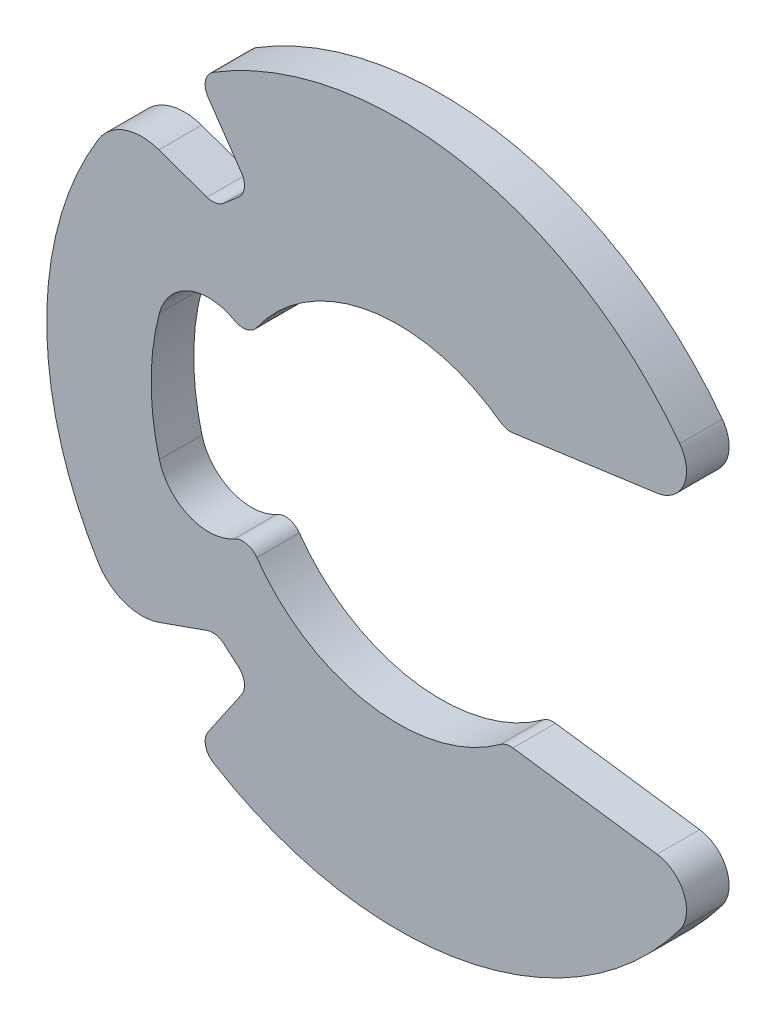
ISO-10303-21;
HEADER;
FILE_DESCRIPTION(('STEP AP214'),'2;1');
FILE_NAME('part.step','',(''),(''),'','','');
FILE_SCHEMA(('AUTOMOTIVE_DESIGN { 1 0 10303 214 1 1 1 1 }'));
ENDSEC;
DATA;
#1=APPLICATION_CONTEXT('core data for automotive mechanical design processes');
#2=APPLICATION_PROTOCOL_DEFINITION('international standard','automotive_design',2000,#1);
#3=PRODUCT_CONTEXT('',#1,'mechanical');
#4=PRODUCT('Part','Part','',(#3));
#5=PRODUCT_RELATED_PRODUCT_CATEGORY('part','',(#4));
#6=PRODUCT_DEFINITION_FORMATION('','',#4);
#7=PRODUCT_DEFINITION_CONTEXT('part definition',#1,'design');
#8=PRODUCT_DEFINITION('design','',#6,#7);
#9=PRODUCT_DEFINITION_SHAPE('','',#8);
#10=(LENGTH_UNIT() NAMED_UNIT(*) SI_UNIT(.MILLI.,.METRE.));
#11=(NAMED_UNIT(*) PLANE_ANGLE_UNIT() SI_UNIT($,.RADIAN.));
#12=(NAMED_UNIT(*) SI_UNIT($,.STERADIAN.) SOLID_ANGLE_UNIT());
#13=UNCERTAINTY_MEASURE_WITH_UNIT(LENGTH_MEASURE(1.E-05),#10,'distance_accuracy_value','');
#14=(GEOMETRIC_REPRESENTATION_CONTEXT(3) GLOBAL_UNCERTAINTY_ASSIGNED_CONTEXT((#13)) GLOBAL_UNIT_ASSIGNED_CONTEXT((#10,
#11,#12)) REPRESENTATION_CONTEXT('',''));
#15=CARTESIAN_POINT('',(0.,0.,0.));
#16=DIRECTION('',(0.,0.,1.));
#17=DIRECTION('',(1.,0.,0.));
#18=AXIS2_PLACEMENT_3D('',#15,#16,#17);
#19=CARTESIAN_POINT('',(0.,0.,1.27));
#20=DIRECTION('',(0.,0.,-1.));
#21=DIRECTION('',(-1.,0.,0.));
#22=AXIS2_PLACEMENT_3D('',#19,#20,#21);
#23=PLANE('',#22);
#24=CARTESIAN_POINT('',(7.57687706687955,-5.66664946537147,1.27));
#25=DIRECTION('',(0.,0.,-1.));
#26=DIRECTION('',(-1.,0.,0.));
#27=AXIS2_PLACEMENT_3D('',#24,#25,#26);
#28=CIRCLE('',#27,1.016);
#29=CARTESIAN_POINT('',(7.71621548730133,-4.66024954258016,1.27));
#30=VERTEX_POINT('',#29);
#31=CARTESIAN_POINT('',(8.39050144990017,-6.27514873682076,1.27));
#32=VERTEX_POINT('',#31);
#33=EDGE_CURVE('E373',#30,#32,#28,.T.);
#34=ORIENTED_EDGE('',*,*,#33,.F.);
#35=DIRECTION('',(0.990551105109562,-0.137144114588364,0.));
#36=VECTOR('',#35,1.);
#37=CARTESIAN_POINT('',(0.,-3.59192148204873,1.27));
#38=LINE('',#37,#36);
#39=CARTESIAN_POINT('',(3.41825205926127,-4.06518646523744,1.27));
#40=VERTEX_POINT('',#39);
#41=EDGE_CURVE('E374',#30,#40,#38,.F.);
#42=ORIENTED_EDGE('',*,*,#41,.T.);
#43=CARTESIAN_POINT('',(3.34858284905039,-4.5683864266331,1.27));
#44=DIRECTION('',(0.,0.,-1.));
#45=DIRECTION('',(-1.,0.,0.));
#46=AXIS2_PLACEMENT_3D('',#43,#44,#45);
#47=CIRCLE('',#46,0.508);
#48=CARTESIAN_POINT('',(3.04826151729699,-4.15866567088125,1.27));
#49=VERTEX_POINT('',#48);
#50=EDGE_CURVE('E17',#49,#40,#47,.T.);
#51=ORIENTED_EDGE('',*,*,#50,.F.);
#52=CARTESIAN_POINT('',(0.,0.,1.27));
#53=DIRECTION('',(0.,0.,-1.));
#54=DIRECTION('',(-1.,0.,0.));
#55=AXIS2_PLACEMENT_3D('',#52,#53,#54);
#56=CIRCLE('',#55,5.1562);
#57=CARTESIAN_POINT('',(-4.21618561440546,-2.96819428354689,1.27));
#58=VERTEX_POINT('',#57);
#59=EDGE_CURVE('E297',#49,#58,#56,.T.);
#60=ORIENTED_EDGE('',*,*,#59,.T.);
#61=CARTESIAN_POINT('',(-4.63157335966707,-3.26062721788648,1.27));
#62=DIRECTION('',(0.,0.,-1.));
#63=DIRECTION('',(-1.,0.,0.));
#64=AXIS2_PLACEMENT_3D('',#61,#62,#63);
#65=CIRCLE('',#64,0.508);
#66=CARTESIAN_POINT('',(-4.88521418696267,-2.82047913970278,1.27));
#67=VERTEX_POINT('',#66);
#68=EDGE_CURVE('E300',#67,#58,#65,.T.);
#69=ORIENTED_EDGE('',*,*,#68,.F.);
#70=CARTESIAN_POINT('',(-5.64613666884946,-1.50003490515168,1.27));
#71=DIRECTION('',(0.,0.,1.));
#72=DIRECTION('',(1.,0.,0.));
#73=AXIS2_PLACEMENT_3D('',#70,#71,#72);
#74=CIRCLE('',#73,1.524);
#75=CARTESIAN_POINT('',(-7.1190418868102,-1.89134835866951,1.27));
#76=VERTEX_POINT('',#75);
#77=EDGE_CURVE('E303',#67,#76,#74,.F.);
#78=ORIENTED_EDGE('',*,*,#77,.T.);
#79=CARTESIAN_POINT('',(0.,0.,1.27));
#80=DIRECTION('',(0.,0.,1.));
#81=DIRECTION('',(1.,0.,0.));
#82=AXIS2_PLACEMENT_3D('',#79,#80,#81);
#83=CIRCLE('',#82,7.366);
#84=CARTESIAN_POINT('',(-7.1190418868102,1.89134835866951,1.27));
#85=VERTEX_POINT('',#84);
#86=EDGE_CURVE('E307',#76,#85,#83,.F.);
#87=ORIENTED_EDGE('',*,*,#86,.T.);
#88=CARTESIAN_POINT('',(-5.64613666884946,1.50003490515168,1.27));
#89=DIRECTION('',(0.,0.,1.));
#90=DIRECTION('',(1.,0.,0.));
#91=AXIS2_PLACEMENT_3D('',#88,#89,#90);
#92=CIRCLE('',#91,1.524);
#93=CARTESIAN_POINT('',(-4.88521418696268,2.82047913970279,1.27));
#94=VERTEX_POINT('',#93);
#95=EDGE_CURVE('E311',#85,#94,#92,.F.);
#96=ORIENTED_EDGE('',*,*,#95,.T.);
#97=CARTESIAN_POINT('',(-4.63157335966708,3.26062721788649,1.27));
#98=DIRECTION('',(0.,0.,1.));
#99=DIRECTION('',(1.,0.,0.));
#100=AXIS2_PLACEMENT_3D('',#97,#98,#99);
#101=CIRCLE('',#100,0.508);
#102=CARTESIAN_POINT('',(-4.21618561440546,2.96819428354689,1.27));
#103=VERTEX_POINT('',#102);
#104=EDGE_CURVE('E313',#103,#94,#101,.F.);
#105=ORIENTED_EDGE('',*,*,#104,.F.);
#106=CARTESIAN_POINT('',(0.,0.,1.27));
#107=DIRECTION('',(0.,0.,-1.));
#108=DIRECTION('',(-1.,0.,0.));
#109=AXIS2_PLACEMENT_3D('',#106,#107,#108);
#110=CIRCLE('',#109,5.1562);
#111=CARTESIAN_POINT('',(3.048261517297,4.15866567088126,1.27));
#112=VERTEX_POINT('',#111);
#113=EDGE_CURVE('E317',#103,#112,#110,.T.);
#114=ORIENTED_EDGE('',*,*,#113,.T.);
#115=CARTESIAN_POINT('',(3.3485828490504,4.5683864266331,1.27));
#116=DIRECTION('',(0.,0.,-1.));
#117=DIRECTION('',(-1.,0.,0.));
#118=AXIS2_PLACEMENT_3D('',#115,#116,#117);
#119=CIRCLE('',#118,0.508);
#120=CARTESIAN_POINT('',(3.41825205926129,4.06518646523745,1.27));
#121=VERTEX_POINT('',#120);
#122=EDGE_CURVE('E321',#121,#112,#119,.T.);
#123=ORIENTED_EDGE('',*,*,#122,.F.);
#124=DIRECTION('',(-0.990551105109562,-0.137144114588364,0.));
#125=VECTOR('',#124,1.);
#126=CARTESIAN_POINT('',(11.2983179723503,5.15619999999999,1.27));
#127=LINE('',#126,#125);
#128=CARTESIAN_POINT('',(7.71621548730134,4.66024954258016,1.27));
#129=VERTEX_POINT('',#128);
#130=EDGE_CURVE('E327',#121,#129,#127,.F.);
#131=ORIENTED_EDGE('',*,*,#130,.T.);
#132=CARTESIAN_POINT('',(7.57687706687956,5.66664946537147,1.27));
#133=DIRECTION('',(0.,0.,-1.));
#134=DIRECTION('',(-1.,0.,0.));
#135=AXIS2_PLACEMENT_3D('',#132,#133,#134);
#136=CIRCLE('',#135,1.016);
#137=CARTESIAN_POINT('',(8.39050144990018,6.27514873682076,1.27));
#138=VERTEX_POINT('',#137);
#139=EDGE_CURVE('E324',#138,#129,#136,.T.);
#140=ORIENTED_EDGE('',*,*,#139,.F.);
#141=CARTESIAN_POINT('',(0.,0.,1.27));
#142=DIRECTION('',(0.,0.,-1.));
#143=DIRECTION('',(-1.,0.,0.));
#144=AXIS2_PLACEMENT_3D('',#141,#142,#143);
#145=CIRCLE('',#144,10.4775);
#146=CARTESIAN_POINT('',(-5.51465485817056,8.90879273780999,1.27));
#147=VERTEX_POINT('',#146);
#148=EDGE_CURVE('E329',#147,#138,#145,.T.);
#149=ORIENTED_EDGE('',*,*,#148,.F.);
#150=CARTESIAN_POINT('',(-5.24727765292592,8.47685127173435,1.27));
#151=DIRECTION('',(0.,0.,-1.));
#152=DIRECTION('',(-1.,0.,0.));
#153=AXIS2_PLACEMENT_3D('',#150,#151,#152);
#154=CIRCLE('',#153,0.508);
#155=CARTESIAN_POINT('',(-5.6664647231543,8.18989099547063,1.27));
#156=VERTEX_POINT('',#155);
#157=EDGE_CURVE('E332',#156,#147,#154,.T.);
#158=ORIENTED_EDGE('',*,*,#157,.F.);
#159=DIRECTION('',(0.564882433590001,-0.825171398087354,0.));
#160=VECTOR('',#159,1.);
#161=CARTESIAN_POINT('',(-7.96096866359448,11.541666359447,1.27));
#162=LINE('',#161,#160);
#163=CARTESIAN_POINT('',(-4.67174469224146,6.73681957776462,1.27));
#164=VERTEX_POINT('',#163);
#165=EDGE_CURVE('E383',#164,#156,#162,.F.);
#166=ORIENTED_EDGE('',*,*,#165,.F.);
#167=CARTESIAN_POINT('',(-5.09093176246983,6.4498593015009,1.27));
#168=DIRECTION('',(0.,0.,-1.));
#169=DIRECTION('',(-1.,0.,0.));
#170=AXIS2_PLACEMENT_3D('',#167,#168,#169);
#171=CIRCLE('',#170,0.508);
#172=CARTESIAN_POINT('',(-4.75923843445855,6.0650950410078,1.27000000000001));
#173=VERTEX_POINT('',#172);
#174=EDGE_CURVE('E336',#164,#173,#171,.T.);
#175=ORIENTED_EDGE('',*,*,#174,.T.);
#176=DIRECTION('',(-0.757409961600578,-0.652939622069462,0.));
#177=VECTOR('',#176,1.);
#178=CARTESIAN_POINT('',(-4.41503502304148,6.36182211981562,1.27000000000001));
#179=LINE('',#178,#177);
#180=CARTESIAN_POINT('',(-5.19974545035898,5.68534761350743,1.27000000000001));
#181=VERTEX_POINT('',#180);
#182=EDGE_CURVE('E387',#181,#173,#179,.F.);
#183=ORIENTED_EDGE('',*,*,#182,.F.);
#184=CARTESIAN_POINT('',(-5.53143877837027,6.07011187400052,1.27));
#185=DIRECTION('',(0.,0.,-1.));
#186=DIRECTION('',(-1.,0.,0.));
#187=AXIS2_PLACEMENT_3D('',#184,#185,#186);
#188=CIRCLE('',#187,0.508);
#189=CARTESIAN_POINT('',(-5.70123922502142,5.59133028672186,1.27));
#190=VERTEX_POINT('',#189);
#191=EDGE_CURVE('E340',#181,#190,#188,.T.);
#192=ORIENTED_EDGE('',*,*,#191,.T.);
#193=DIRECTION('',(-0.942483439524914,0.334252847738487,0.));
#194=VECTOR('',#193,1.);
#195=CARTESIAN_POINT('',(-5.42319262672811,5.49272073732714,1.27));
#196=LINE('',#195,#194);
#197=CARTESIAN_POINT('',(-7.13394241485243,6.09944013892937,1.27));
#198=VERTEX_POINT('',#197);
#199=EDGE_CURVE('E390',#198,#190,#196,.F.);
#200=ORIENTED_EDGE('',*,*,#199,.F.);
#201=CARTESIAN_POINT('',(-7.64334375480589,4.6630953770934,1.27));
#202=DIRECTION('',(0.,0.,-1.));
#203=DIRECTION('',(-1.,0.,0.));
#204=AXIS2_PLACEMENT_3D('',#201,#202,#203);
#205=CIRCLE('',#204,1.524);
#206=CARTESIAN_POINT('',(-8.94433843647498,5.45681373915185,1.27));
#207=VERTEX_POINT('',#206);
#208=EDGE_CURVE('E344',#207,#198,#205,.T.);
#209=ORIENTED_EDGE('',*,*,#208,.F.);
#210=CARTESIAN_POINT('',(0.,0.,1.27));
#211=DIRECTION('',(0.,0.,-1.));
#212=DIRECTION('',(-1.,0.,0.));
#213=AXIS2_PLACEMENT_3D('',#210,#211,#212);
#214=CIRCLE('',#213,10.4775);
#215=CARTESIAN_POINT('',(-8.94433843647497,-5.45681373915185,1.27));
#216=VERTEX_POINT('',#215);
#217=EDGE_CURVE('E348',#216,#207,#214,.T.);
#218=ORIENTED_EDGE('',*,*,#217,.F.);
#219=CARTESIAN_POINT('',(-7.64334375480588,-4.6630953770934,1.27));
#220=DIRECTION('',(0.,0.,-1.));
#221=DIRECTION('',(-1.,0.,0.));
#222=AXIS2_PLACEMENT_3D('',#219,#220,#221);
#223=CIRCLE('',#222,1.524);
#224=CARTESIAN_POINT('',(-7.13394241485243,-6.09944013892937,1.27));
#225=VERTEX_POINT('',#224);
#226=EDGE_CURVE('E352',#225,#216,#223,.T.);
#227=ORIENTED_EDGE('',*,*,#226,.F.);
#228=DIRECTION('',(-0.942483439524914,-0.334252847738487,0.));
#229=VECTOR('',#228,1.);
#230=CARTESIAN_POINT('',(-5.42319262672811,-5.49272073732714,1.27));
#231=LINE('',#230,#229);
#232=CARTESIAN_POINT('',(-5.70123922502142,-5.59133028672186,1.27));
#233=VERTEX_POINT('',#232);
#234=EDGE_CURVE('E393',#225,#233,#231,.F.);
#235=ORIENTED_EDGE('',*,*,#234,.T.);
#236=CARTESIAN_POINT('',(-5.53143877837027,-6.07011187400052,1.27));
#237=DIRECTION('',(0.,0.,-1.));
#238=DIRECTION('',(-1.,0.,0.));
#239=AXIS2_PLACEMENT_3D('',#236,#237,#238);
#240=CIRCLE('',#239,0.508);
#241=CARTESIAN_POINT('',(-5.19974545035898,-5.68534761350743,1.27000000000001));
#242=VERTEX_POINT('',#241);
#243=EDGE_CURVE('E357',#233,#242,#240,.T.);
#244=ORIENTED_EDGE('',*,*,#243,.T.);
#245=DIRECTION('',(-0.757409961600578,0.652939622069462,0.));
#246=VECTOR('',#245,1.);
#247=CARTESIAN_POINT('',(-4.41503502304148,-6.36182211981562,1.27000000000001));
#248=LINE('',#247,#246);
#249=CARTESIAN_POINT('',(-4.75923843445855,-6.0650950410078,1.27000000000001));
#250=VERTEX_POINT('',#249);
#251=EDGE_CURVE('E395',#242,#250,#248,.F.);
#252=ORIENTED_EDGE('',*,*,#251,.T.);
#253=CARTESIAN_POINT('',(-5.09093176246983,-6.4498593015009,1.27));
#254=DIRECTION('',(0.,0.,-1.));
#255=DIRECTION('',(-1.,0.,0.));
#256=AXIS2_PLACEMENT_3D('',#253,#254,#255);
#257=CIRCLE('',#256,0.508);
#258=CARTESIAN_POINT('',(-4.67174469224146,-6.73681957776462,1.27));
#259=VERTEX_POINT('',#258);
#260=EDGE_CURVE('E361',#250,#259,#257,.T.);
#261=ORIENTED_EDGE('',*,*,#260,.T.);
#262=DIRECTION('',(0.56488243359,0.825171398087354,0.));
#263=VECTOR('',#262,1.);
#264=CARTESIAN_POINT('',(-7.96096866359448,-11.541666359447,1.27));
#265=LINE('',#264,#263);
#266=CARTESIAN_POINT('',(-5.66646472315429,-8.18989099547062,1.27));
#267=VERTEX_POINT('',#266);
#268=EDGE_CURVE('E368',#259,#267,#265,.F.);
#269=ORIENTED_EDGE('',*,*,#268,.T.);
#270=CARTESIAN_POINT('',(-5.24727765292592,-8.47685127173434,1.27));
#271=DIRECTION('',(0.,0.,-1.));
#272=DIRECTION('',(-1.,0.,0.));
#273=AXIS2_PLACEMENT_3D('',#270,#271,#272);
#274=CIRCLE('',#273,0.508);
#275=CARTESIAN_POINT('',(-5.51465485817055,-8.90879273780997,1.27));
#276=VERTEX_POINT('',#275);
#277=EDGE_CURVE('E365',#276,#267,#274,.T.);
#278=ORIENTED_EDGE('',*,*,#277,.F.);
#279=CARTESIAN_POINT('',(0.,0.,1.27));
#280=DIRECTION('',(0.,0.,-1.));
#281=DIRECTION('',(-1.,0.,0.));
#282=AXIS2_PLACEMENT_3D('',#279,#280,#281);
#283=CIRCLE('',#282,10.4775);
#284=EDGE_CURVE('E370',#32,#276,#283,.T.);
#285=ORIENTED_EDGE('',*,*,#284,.F.);
#286=EDGE_LOOP('',(#34,#42,#51,#60,#69,#78,#87,#96,#105,#114,#123,#131,#140,#149,#158,#166,#175,
#183,#192,#200,#209,#218,#227,#235,#244,#252,#261,#269,#278,#285));
#287=FACE_BOUND('',#286,.T.);
#288=ADVANCED_FACE('F14',(#287),#23,.F.);
#289=CARTESIAN_POINT('',(0.,-3.59192148204873,-28.9774986298856));
#290=DIRECTION('',(-0.137144114588364,-0.990551105109562,0.));
#291=DIRECTION('',(0.990551105109562,-0.137144114588364,0.));
#292=AXIS2_PLACEMENT_3D('',#289,#290,#291);
#293=PLANE('',#292);
#294=DIRECTION('',(0.,0.,-1.));
#295=VECTOR('',#294,1.);
#296=CARTESIAN_POINT('',(7.71621548730133,-4.66024954258016,1.27));
#297=LINE('',#296,#295);
#298=CARTESIAN_POINT('',(7.71621548730133,-4.66024954258016,0.));
#299=VERTEX_POINT('',#298);
#300=EDGE_CURVE('E219',#299,#30,#297,.F.);
#301=ORIENTED_EDGE('',*,*,#300,.F.);
#302=DIRECTION('',(0.990551105109562,-0.137144114588363,0.));
#303=VECTOR('',#302,1.);
#304=CARTESIAN_POINT('',(3.41825205926127,-4.06518646523744,0.));
#305=LINE('',#304,#303);
#306=CARTESIAN_POINT('',(3.41825205926127,-4.06518646523744,0.));
#307=VERTEX_POINT('',#306);
#308=EDGE_CURVE('E214',#307,#299,#305,.T.);
#309=ORIENTED_EDGE('',*,*,#308,.F.);
#310=DIRECTION('',(0.,0.,-1.));
#311=VECTOR('',#310,1.);
#312=CARTESIAN_POINT('',(3.41825205926127,-4.06518646523744,1.27));
#313=LINE('',#312,#311);
#314=EDGE_CURVE('E217',#40,#307,#313,.T.);
#315=ORIENTED_EDGE('',*,*,#314,.F.);
#316=ORIENTED_EDGE('',*,*,#41,.F.);
#317=EDGE_LOOP('',(#301,#309,#315,#316));
#318=FACE_BOUND('',#317,.T.);
#319=ADVANCED_FACE('F215',(#318),#293,.F.);
#320=CARTESIAN_POINT('',(7.57687706687955,-5.66664946537147,1.27));
#321=DIRECTION('',(0.,0.,-1.));
#322=DIRECTION('',(-1.,0.,0.));
#323=AXIS2_PLACEMENT_3D('',#320,#321,#322);
#324=CYLINDRICAL_SURFACE('',#323,1.016);
#325=CARTESIAN_POINT('',(7.57687706687955,-5.66664946537147,0.));
#326=DIRECTION('',(0.,0.,-1.));
#327=DIRECTION('',(-1.,0.,0.));
#328=AXIS2_PLACEMENT_3D('',#325,#326,#327);
#329=CIRCLE('',#328,1.016);
#330=CARTESIAN_POINT('',(8.39050144990017,-6.27514873682076,0.));
#331=VERTEX_POINT('',#330);
#332=EDGE_CURVE('E223',#299,#331,#329,.T.);
#333=ORIENTED_EDGE('',*,*,#332,.F.);
#334=ORIENTED_EDGE('',*,*,#300,.T.);
#335=ORIENTED_EDGE('',*,*,#33,.T.);
#336=DIRECTION('',(0.,0.,-1.));
#337=VECTOR('',#336,1.);
#338=CARTESIAN_POINT('',(8.39050144990017,-6.27514873682076,1.27));
#339=LINE('',#338,#337);
#340=EDGE_CURVE('E372',#331,#32,#339,.F.);
#341=ORIENTED_EDGE('',*,*,#340,.F.);
#342=EDGE_LOOP('',(#333,#334,#335,#341));
#343=FACE_BOUND('',#342,.T.);
#344=ADVANCED_FACE('F411',(#343),#324,.T.);
#345=CARTESIAN_POINT('',(0.,0.,1.27));
#346=DIRECTION('',(0.,0.,-1.));
#347=DIRECTION('',(-1.,0.,0.));
#348=AXIS2_PLACEMENT_3D('',#345,#346,#347);
#349=CYLINDRICAL_SURFACE('',#348,10.4775);
#350=ORIENTED_EDGE('',*,*,#284,.T.);
#351=DIRECTION('',(0.,0.,-1.));
#352=VECTOR('',#351,1.);
#353=CARTESIAN_POINT('',(-5.51465485817055,-8.90879273780998,1.27));
#354=LINE('',#353,#352);
#355=CARTESIAN_POINT('',(-5.51465485817055,-8.90879273780997,0.));
#356=VERTEX_POINT('',#355);
#357=EDGE_CURVE('E369',#356,#276,#354,.F.);
#358=ORIENTED_EDGE('',*,*,#357,.F.);
#359=CARTESIAN_POINT('',(0.,0.,0.));
#360=DIRECTION('',(0.,0.,-1.));
#361=DIRECTION('',(-1.,0.,0.));
#362=AXIS2_PLACEMENT_3D('',#359,#360,#361);
#363=CIRCLE('',#362,10.4775);
#364=EDGE_CURVE('E293',#331,#356,#363,.T.);
#365=ORIENTED_EDGE('',*,*,#364,.F.);
#366=ORIENTED_EDGE('',*,*,#340,.T.);
#367=EDGE_LOOP('',(#350,#358,#365,#366));
#368=FACE_BOUND('',#367,.T.);
#369=ADVANCED_FACE('F410',(#368),#349,.T.);
#370=CARTESIAN_POINT('',(-5.24727765292592,-8.47685127173434,1.27));
#371=DIRECTION('',(0.,0.,-1.));
#372=DIRECTION('',(-1.,0.,0.));
#373=AXIS2_PLACEMENT_3D('',#370,#371,#372);
#374=CYLINDRICAL_SURFACE('',#373,0.508);
#375=DIRECTION('',(0.,0.,1.));
#376=VECTOR('',#375,1.);
#377=CARTESIAN_POINT('',(-5.66646472315429,-8.18989099547062,-28.9619533727259));
#378=LINE('',#377,#376);
#379=CARTESIAN_POINT('',(-5.6664647231543,-8.18989099547062,0.));
#380=VERTEX_POINT('',#379);
#381=EDGE_CURVE('E364',#267,#380,#378,.F.);
#382=ORIENTED_EDGE('',*,*,#381,.T.);
#383=CARTESIAN_POINT('',(-5.24727765292592,-8.47685127173434,0.));
#384=DIRECTION('',(0.,0.,-1.));
#385=DIRECTION('',(-1.,0.,0.));
#386=AXIS2_PLACEMENT_3D('',#383,#384,#385);
#387=CIRCLE('',#386,0.508);
#388=EDGE_CURVE('E291',#356,#380,#387,.T.);
#389=ORIENTED_EDGE('',*,*,#388,.F.);
#390=ORIENTED_EDGE('',*,*,#357,.T.);
#391=ORIENTED_EDGE('',*,*,#277,.T.);
#392=EDGE_LOOP('',(#382,#389,#390,#391));
#393=FACE_BOUND('',#392,.T.);
#394=ADVANCED_FACE('F413',(#393),#374,.T.);
#395=CARTESIAN_POINT('',(-7.96096866359448,-11.541666359447,-28.9619533727259));
#396=DIRECTION('',(0.825171398087354,-0.56488243359,0.));
#397=DIRECTION('',(0.56488243359,0.825171398087354,0.));
#398=AXIS2_PLACEMENT_3D('',#395,#396,#397);
#399=PLANE('',#398);
#400=ORIENTED_EDGE('',*,*,#381,.F.);
#401=ORIENTED_EDGE('',*,*,#268,.F.);
#402=DIRECTION('',(0.,0.,-1.));
#403=VECTOR('',#402,1.);
#404=CARTESIAN_POINT('',(-4.67174469224146,-6.73681957776462,-28.9619533727259));
#405=LINE('',#404,#403);
#406=CARTESIAN_POINT('',(-4.67174469224146,-6.73681957776462,0.));
#407=VERTEX_POINT('',#406);
#408=EDGE_CURVE('E363',#259,#407,#405,.T.);
#409=ORIENTED_EDGE('',*,*,#408,.T.);
#410=DIRECTION('',(0.564882433590003,0.825171398087353,0.));
#411=VECTOR('',#410,1.);
#412=CARTESIAN_POINT('',(-5.6664647231543,-8.18989099547062,0.));
#413=LINE('',#412,#411);
#414=EDGE_CURVE('E290',#380,#407,#413,.T.);
#415=ORIENTED_EDGE('',*,*,#414,.F.);
#416=EDGE_LOOP('',(#400,#401,#409,#415));
#417=FACE_BOUND('',#416,.T.);
#418=ADVANCED_FACE('F415',(#417),#399,.F.);
#419=CARTESIAN_POINT('',(-5.09093176246983,-6.4498593015009,-28.9619533727259));
#420=DIRECTION('',(0.,0.,-1.));
#421=DIRECTION('',(-1.,0.,0.));
#422=AXIS2_PLACEMENT_3D('',#419,#420,#421);
#423=CYLINDRICAL_SURFACE('',#422,0.508);
#424=ORIENTED_EDGE('',*,*,#408,.F.);
#425=ORIENTED_EDGE('',*,*,#260,.F.);
#426=DIRECTION('',(0.,0.,1.));
#427=VECTOR('',#426,1.);
#428=CARTESIAN_POINT('',(-4.75923843445855,-6.0650950410078,-28.9619533727259));
#429=LINE('',#428,#427);
#430=CARTESIAN_POINT('',(-4.75923843445855,-6.0650950410078,0.));
#431=VERTEX_POINT('',#430);
#432=EDGE_CURVE('E360',#250,#431,#429,.F.);
#433=ORIENTED_EDGE('',*,*,#432,.T.);
#434=CARTESIAN_POINT('',(-5.09093176246983,-6.4498593015009,0.));
#435=DIRECTION('',(0.,0.,-1.));
#436=DIRECTION('',(-1.,0.,0.));
#437=AXIS2_PLACEMENT_3D('',#434,#435,#436);
#438=CIRCLE('',#437,0.508);
#439=EDGE_CURVE('E287',#407,#431,#438,.F.);
#440=ORIENTED_EDGE('',*,*,#439,.F.);
#441=EDGE_LOOP('',(#424,#425,#433,#440));
#442=FACE_BOUND('',#441,.T.);
#443=ADVANCED_FACE('F460',(#442),#423,.F.);
#444=CARTESIAN_POINT('',(-4.41503502304148,-6.36182211981562,-28.9619533727259));
#445=DIRECTION('',(0.652939622069462,0.757409961600578,0.));
#446=DIRECTION('',(-0.757409961600578,0.652939622069462,0.));
#447=AXIS2_PLACEMENT_3D('',#444,#445,#446);
#448=PLANE('',#447);
#449=ORIENTED_EDGE('',*,*,#432,.F.);
#450=ORIENTED_EDGE('',*,*,#251,.F.);
#451=DIRECTION('',(0.,0.,-1.));
#452=VECTOR('',#451,1.);
#453=CARTESIAN_POINT('',(-5.19974545035899,-5.68534761350743,-28.9619533727259));
#454=LINE('',#453,#452);
#455=CARTESIAN_POINT('',(-5.19974545035898,-5.68534761350743,0.));
#456=VERTEX_POINT('',#455);
#457=EDGE_CURVE('E359',#242,#456,#454,.T.);
#458=ORIENTED_EDGE('',*,*,#457,.T.);
#459=DIRECTION('',(-0.757409961600581,0.652939622069458,0.));
#460=VECTOR('',#459,1.);
#461=CARTESIAN_POINT('',(-4.75923843445854,-6.0650950410078,0.));
#462=LINE('',#461,#460);
#463=EDGE_CURVE('E286',#431,#456,#462,.T.);
#464=ORIENTED_EDGE('',*,*,#463,.F.);
#465=EDGE_LOOP('',(#449,#450,#458,#464));
#466=FACE_BOUND('',#465,.T.);
#467=ADVANCED_FACE('F464',(#466),#448,.F.);
#468=CARTESIAN_POINT('',(-5.53143877837027,-6.07011187400052,-28.9619533727259));
#469=DIRECTION('',(0.,0.,-1.));
#470=DIRECTION('',(-1.,0.,0.));
#471=AXIS2_PLACEMENT_3D('',#468,#469,#470);
#472=CYLINDRICAL_SURFACE('',#471,0.508);
#473=ORIENTED_EDGE('',*,*,#457,.F.);
#474=ORIENTED_EDGE('',*,*,#243,.F.);
#475=DIRECTION('',(0.,0.,1.));
#476=VECTOR('',#475,1.);
#477=CARTESIAN_POINT('',(-5.70123922502142,-5.59133028672186,-28.9619533727259));
#478=LINE('',#477,#476);
#479=CARTESIAN_POINT('',(-5.70123922502142,-5.59133028672186,0.));
#480=VERTEX_POINT('',#479);
#481=EDGE_CURVE('E356',#233,#480,#478,.F.);
#482=ORIENTED_EDGE('',*,*,#481,.T.);
#483=CARTESIAN_POINT('',(-5.53143877837027,-6.07011187400052,0.));
#484=DIRECTION('',(0.,0.,-1.));
#485=DIRECTION('',(-1.,0.,0.));
#486=AXIS2_PLACEMENT_3D('',#483,#484,#485);
#487=CIRCLE('',#486,0.508);
#488=EDGE_CURVE('E283',#456,#480,#487,.F.);
#489=ORIENTED_EDGE('',*,*,#488,.F.);
#490=EDGE_LOOP('',(#473,#474,#482,#489));
#491=FACE_BOUND('',#490,.T.);
#492=ADVANCED_FACE('F470',(#491),#472,.F.);
#493=CARTESIAN_POINT('',(-5.42319262672811,-5.49272073732714,-28.9619533727259));
#494=DIRECTION('',(-0.334252847738487,0.942483439524914,0.));
#495=DIRECTION('',(-0.942483439524914,-0.334252847738487,0.));
#496=AXIS2_PLACEMENT_3D('',#493,#494,#495);
#497=PLANE('',#496);
#498=ORIENTED_EDGE('',*,*,#481,.F.);
#499=ORIENTED_EDGE('',*,*,#234,.F.);
#500=DIRECTION('',(0.,0.,-1.));
#501=VECTOR('',#500,1.);
#502=CARTESIAN_POINT('',(-7.13394241485243,-6.09944013892937,1.27));
#503=LINE('',#502,#501);
#504=CARTESIAN_POINT('',(-7.13394241485243,-6.09944013892937,0.));
#505=VERTEX_POINT('',#504);
#506=EDGE_CURVE('E355',#505,#225,#503,.F.);
#507=ORIENTED_EDGE('',*,*,#506,.F.);
#508=DIRECTION('',(-0.942483439524914,-0.334252847738488,0.));
#509=VECTOR('',#508,1.);
#510=CARTESIAN_POINT('',(-5.70123922502142,-5.59133028672186,0.));
#511=LINE('',#510,#509);
#512=EDGE_CURVE('E282',#480,#505,#511,.T.);
#513=ORIENTED_EDGE('',*,*,#512,.F.);
#514=EDGE_LOOP('',(#498,#499,#507,#513));
#515=FACE_BOUND('',#514,.T.);
#516=ADVANCED_FACE('F475',(#515),#497,.F.);
#517=CARTESIAN_POINT('',(-7.64334375480588,-4.6630953770934,1.27));
#518=DIRECTION('',(0.,0.,-1.));
#519=DIRECTION('',(-1.,0.,0.));
#520=AXIS2_PLACEMENT_3D('',#517,#518,#519);
#521=CYLINDRICAL_SURFACE('',#520,1.524);
#522=CARTESIAN_POINT('',(-7.64334375480588,-4.6630953770934,0.));
#523=DIRECTION('',(0.,0.,-1.));
#524=DIRECTION('',(-1.,0.,0.));
#525=AXIS2_PLACEMENT_3D('',#522,#523,#524);
#526=CIRCLE('',#525,1.524);
#527=CARTESIAN_POINT('',(-8.94433843647497,-5.45681373915185,0.));
#528=VERTEX_POINT('',#527);
#529=EDGE_CURVE('E279',#505,#528,#526,.T.);
#530=ORIENTED_EDGE('',*,*,#529,.F.);
#531=ORIENTED_EDGE('',*,*,#506,.T.);
#532=ORIENTED_EDGE('',*,*,#226,.T.);
#533=DIRECTION('',(0.,0.,-1.));
#534=VECTOR('',#533,1.);
#535=CARTESIAN_POINT('',(-8.94433843647497,-5.45681373915185,1.27));
#536=LINE('',#535,#534);
#537=EDGE_CURVE('E351',#528,#216,#536,.F.);
#538=ORIENTED_EDGE('',*,*,#537,.F.);
#539=EDGE_LOOP('',(#530,#531,#532,#538));
#540=FACE_BOUND('',#539,.T.);
#541=ADVANCED_FACE('F556',(#540),#521,.T.);
#542=CARTESIAN_POINT('',(0.,0.,1.27));
#543=DIRECTION('',(0.,0.,-1.));
#544=DIRECTION('',(-1.,0.,0.));
#545=AXIS2_PLACEMENT_3D('',#542,#543,#544);
#546=CYLINDRICAL_SURFACE('',#545,10.4775);
#547=DIRECTION('',(0.,0.,-1.));
#548=VECTOR('',#547,1.);
#549=CARTESIAN_POINT('',(-8.94433843647498,5.45681373915185,1.27));
#550=LINE('',#549,#548);
#551=CARTESIAN_POINT('',(-8.94433843647498,5.45681373915185,0.));
#552=VERTEX_POINT('',#551);
#553=EDGE_CURVE('E347',#552,#207,#550,.F.);
#554=ORIENTED_EDGE('',*,*,#553,.F.);
#555=CARTESIAN_POINT('',(0.,0.,0.));
#556=DIRECTION('',(0.,0.,-1.));
#557=DIRECTION('',(-1.,0.,0.));
#558=AXIS2_PLACEMENT_3D('',#555,#556,#557);
#559=CIRCLE('',#558,10.4775);
#560=EDGE_CURVE('E277',#528,#552,#559,.T.);
#561=ORIENTED_EDGE('',*,*,#560,.F.);
#562=ORIENTED_EDGE('',*,*,#537,.T.);
#563=ORIENTED_EDGE('',*,*,#217,.T.);
#564=EDGE_LOOP('',(#554,#561,#562,#563));
#565=FACE_BOUND('',#564,.T.);
#566=ADVANCED_FACE('F554',(#565),#546,.T.);
#567=CARTESIAN_POINT('',(-7.64334375480589,4.6630953770934,1.27));
#568=DIRECTION('',(0.,0.,-1.));
#569=DIRECTION('',(-1.,0.,0.));
#570=AXIS2_PLACEMENT_3D('',#567,#568,#569);
#571=CYLINDRICAL_SURFACE('',#570,1.524);
#572=CARTESIAN_POINT('',(-7.64334375480589,4.6630953770934,0.));
#573=DIRECTION('',(0.,0.,-1.));
#574=DIRECTION('',(-1.,0.,0.));
#575=AXIS2_PLACEMENT_3D('',#572,#573,#574);
#576=CIRCLE('',#575,1.524);
#577=CARTESIAN_POINT('',(-7.13394241485243,6.09944013892937,0.));
#578=VERTEX_POINT('',#577);
#579=EDGE_CURVE('E274',#552,#578,#576,.T.);
#580=ORIENTED_EDGE('',*,*,#579,.F.);
#581=ORIENTED_EDGE('',*,*,#553,.T.);
#582=ORIENTED_EDGE('',*,*,#208,.T.);
#583=DIRECTION('',(0.,0.,1.));
#584=VECTOR('',#583,1.);
#585=CARTESIAN_POINT('',(-7.13394241485243,6.09944013892937,-28.9619533727259));
#586=LINE('',#585,#584);
#587=EDGE_CURVE('E343',#578,#198,#586,.T.);
#588=ORIENTED_EDGE('',*,*,#587,.F.);
#589=EDGE_LOOP('',(#580,#581,#582,#588));
#590=FACE_BOUND('',#589,.T.);
#591=ADVANCED_FACE('F550',(#590),#571,.T.);
#592=CARTESIAN_POINT('',(-5.42319262672811,5.49272073732714,-28.9619533727259));
#593=DIRECTION('',(0.334252847738487,0.942483439524914,0.));
#594=DIRECTION('',(-0.942483439524914,0.334252847738487,0.));
#595=AXIS2_PLACEMENT_3D('',#592,#593,#594);
#596=PLANE('',#595);
#597=DIRECTION('',(0.942483439524914,-0.334252847738487,0.));
#598=VECTOR('',#597,1.);
#599=CARTESIAN_POINT('',(-7.13394241485243,6.09944013892937,0.));
#600=LINE('',#599,#598);
#601=CARTESIAN_POINT('',(-5.70123922502142,5.59133028672186,0.));
#602=VERTEX_POINT('',#601);
#603=EDGE_CURVE('E273',#578,#602,#600,.T.);
#604=ORIENTED_EDGE('',*,*,#603,.F.);
#605=ORIENTED_EDGE('',*,*,#587,.T.);
#606=ORIENTED_EDGE('',*,*,#199,.T.);
#607=DIRECTION('',(0.,0.,-1.));
#608=VECTOR('',#607,1.);
#609=CARTESIAN_POINT('',(-5.70123922502142,5.59133028672186,-28.9619533727259));
#610=LINE('',#609,#608);
#611=EDGE_CURVE('E342',#190,#602,#610,.T.);
#612=ORIENTED_EDGE('',*,*,#611,.T.);
#613=EDGE_LOOP('',(#604,#605,#606,#612));
#614=FACE_BOUND('',#613,.T.);
#615=ADVANCED_FACE('F547',(#614),#596,.T.);
#616=CARTESIAN_POINT('',(-5.53143877837027,6.07011187400052,-28.9619533727259));
#617=DIRECTION('',(0.,0.,-1.));
#618=DIRECTION('',(-1.,0.,0.));
#619=AXIS2_PLACEMENT_3D('',#616,#617,#618);
#620=CYLINDRICAL_SURFACE('',#619,0.508);
#621=ORIENTED_EDGE('',*,*,#611,.F.);
#622=ORIENTED_EDGE('',*,*,#191,.F.);
#623=DIRECTION('',(0.,0.,1.));
#624=VECTOR('',#623,1.);
#625=CARTESIAN_POINT('',(-5.19974545035898,5.68534761350743,-28.9619533727259));
#626=LINE('',#625,#624);
#627=CARTESIAN_POINT('',(-5.19974545035898,5.68534761350743,0.));
#628=VERTEX_POINT('',#627);
#629=EDGE_CURVE('E339',#628,#181,#626,.T.);
#630=ORIENTED_EDGE('',*,*,#629,.F.);
#631=CARTESIAN_POINT('',(-5.53143877837027,6.07011187400052,0.));
#632=DIRECTION('',(0.,0.,-1.));
#633=DIRECTION('',(-1.,0.,0.));
#634=AXIS2_PLACEMENT_3D('',#631,#632,#633);
#635=CIRCLE('',#634,0.508);
#636=EDGE_CURVE('E270',#602,#628,#635,.F.);
#637=ORIENTED_EDGE('',*,*,#636,.F.);
#638=EDGE_LOOP('',(#621,#622,#630,#637));
#639=FACE_BOUND('',#638,.T.);
#640=ADVANCED_FACE('F543',(#639),#620,.F.);
#641=CARTESIAN_POINT('',(-4.41503502304148,6.36182211981562,-28.9619533727259));
#642=DIRECTION('',(-0.652939622069462,0.757409961600578,0.));
#643=DIRECTION('',(-0.757409961600578,-0.652939622069462,0.));
#644=AXIS2_PLACEMENT_3D('',#641,#642,#643);
#645=PLANE('',#644);
#646=DIRECTION('',(0.757409961600573,0.652939622069468,0.));
#647=VECTOR('',#646,1.);
#648=CARTESIAN_POINT('',(-5.19974545035898,5.68534761350743,0.));
#649=LINE('',#648,#647);
#650=CARTESIAN_POINT('',(-4.75923843445855,6.0650950410078,0.));
#651=VERTEX_POINT('',#650);
#652=EDGE_CURVE('E269',#628,#651,#649,.T.);
#653=ORIENTED_EDGE('',*,*,#652,.F.);
#654=ORIENTED_EDGE('',*,*,#629,.T.);
#655=ORIENTED_EDGE('',*,*,#182,.T.);
#656=DIRECTION('',(0.,0.,-1.));
#657=VECTOR('',#656,1.);
#658=CARTESIAN_POINT('',(-4.75923843445855,6.0650950410078,-28.9619533727259));
#659=LINE('',#658,#657);
#660=EDGE_CURVE('E338',#173,#651,#659,.T.);
#661=ORIENTED_EDGE('',*,*,#660,.T.);
#662=EDGE_LOOP('',(#653,#654,#655,#661));
#663=FACE_BOUND('',#662,.T.);
#664=ADVANCED_FACE('F539',(#663),#645,.T.);
#665=CARTESIAN_POINT('',(-5.09093176246983,6.4498593015009,-28.9619533727259));
#666=DIRECTION('',(0.,0.,-1.));
#667=DIRECTION('',(-1.,0.,0.));
#668=AXIS2_PLACEMENT_3D('',#665,#666,#667);
#669=CYLINDRICAL_SURFACE('',#668,0.508);
#670=ORIENTED_EDGE('',*,*,#660,.F.);
#671=ORIENTED_EDGE('',*,*,#174,.F.);
#672=DIRECTION('',(0.,0.,1.));
#673=VECTOR('',#672,1.);
#674=CARTESIAN_POINT('',(-4.67174469224146,6.73681957776462,-28.9619533727259));
#675=LINE('',#674,#673);
#676=CARTESIAN_POINT('',(-4.67174469224146,6.73681957776462,0.));
#677=VERTEX_POINT('',#676);
#678=EDGE_CURVE('E386',#677,#164,#675,.T.);
#679=ORIENTED_EDGE('',*,*,#678,.F.);
#680=CARTESIAN_POINT('',(-5.09093176246983,6.4498593015009,0.));
#681=DIRECTION('',(0.,0.,-1.));
#682=DIRECTION('',(-1.,0.,0.));
#683=AXIS2_PLACEMENT_3D('',#680,#681,#682);
#684=CIRCLE('',#683,0.508);
#685=EDGE_CURVE('E266',#651,#677,#684,.F.);
#686=ORIENTED_EDGE('',*,*,#685,.F.);
#687=EDGE_LOOP('',(#670,#671,#679,#686));
#688=FACE_BOUND('',#687,.T.);
#689=ADVANCED_FACE('F535',(#688),#669,.F.);
#690=CARTESIAN_POINT('',(-7.96096866359448,11.541666359447,-28.9619533727259));
#691=DIRECTION('',(-0.825171398087354,-0.564882433590001,0.));
#692=DIRECTION('',(0.564882433590001,-0.825171398087354,0.));
#693=AXIS2_PLACEMENT_3D('',#690,#691,#692);
#694=PLANE('',#693);
#695=DIRECTION('',(-0.56488243359,0.825171398087354,0.));
#696=VECTOR('',#695,1.);
#697=CARTESIAN_POINT('',(-4.67174469224146,6.73681957776462,0.));
#698=LINE('',#697,#696);
#699=CARTESIAN_POINT('',(-5.6664647231543,8.18989099547063,0.));
#700=VERTEX_POINT('',#699);
#701=EDGE_CURVE('E265',#677,#700,#698,.T.);
#702=ORIENTED_EDGE('',*,*,#701,.F.);
#703=ORIENTED_EDGE('',*,*,#678,.T.);
#704=ORIENTED_EDGE('',*,*,#165,.T.);
#705=DIRECTION('',(0.,0.,-1.));
#706=VECTOR('',#705,1.);
#707=CARTESIAN_POINT('',(-5.6664647231543,8.18989099547063,1.27));
#708=LINE('',#707,#706);
#709=EDGE_CURVE('E335',#700,#156,#708,.F.);
#710=ORIENTED_EDGE('',*,*,#709,.F.);
#711=EDGE_LOOP('',(#702,#703,#704,#710));
#712=FACE_BOUND('',#711,.T.);
#713=ADVANCED_FACE('F531',(#712),#694,.T.);
#714=CARTESIAN_POINT('',(-5.24727765292592,8.47685127173435,1.27));
#715=DIRECTION('',(0.,0.,-1.));
#716=DIRECTION('',(-1.,0.,0.));
#717=AXIS2_PLACEMENT_3D('',#714,#715,#716);
#718=CYLINDRICAL_SURFACE('',#717,0.508);
#719=DIRECTION('',(0.,0.,-1.));
#720=VECTOR('',#719,1.);
#721=CARTESIAN_POINT('',(-5.51465485817056,8.90879273780999,1.27));
#722=LINE('',#721,#720);
#723=CARTESIAN_POINT('',(-5.51465485817056,8.90879273780999,0.));
#724=VERTEX_POINT('',#723);
#725=EDGE_CURVE('E331',#724,#147,#722,.F.);
#726=ORIENTED_EDGE('',*,*,#725,.F.);
#727=CARTESIAN_POINT('',(-5.24727765292592,8.47685127173435,0.));
#728=DIRECTION('',(0.,0.,-1.));
#729=DIRECTION('',(-1.,0.,0.));
#730=AXIS2_PLACEMENT_3D('',#727,#728,#729);
#731=CIRCLE('',#730,0.508);
#732=EDGE_CURVE('E263',#700,#724,#731,.T.);
#733=ORIENTED_EDGE('',*,*,#732,.F.);
#734=ORIENTED_EDGE('',*,*,#709,.T.);
#735=ORIENTED_EDGE('',*,*,#157,.T.);
#736=EDGE_LOOP('',(#726,#733,#734,#735));
#737=FACE_BOUND('',#736,.T.);
#738=ADVANCED_FACE('F527',(#737),#718,.T.);
#739=CARTESIAN_POINT('',(0.,0.,1.27));
#740=DIRECTION('',(0.,0.,-1.));
#741=DIRECTION('',(-1.,0.,0.));
#742=AXIS2_PLACEMENT_3D('',#739,#740,#741);
#743=CYLINDRICAL_SURFACE('',#742,10.4775);
#744=CARTESIAN_POINT('',(0.,0.,0.));
#745=DIRECTION('',(0.,0.,-1.));
#746=DIRECTION('',(-1.,0.,0.));
#747=AXIS2_PLACEMENT_3D('',#744,#745,#746);
#748=CIRCLE('',#747,10.4775);
#749=CARTESIAN_POINT('',(8.39050144990018,6.27514873682076,0.));
#750=VERTEX_POINT('',#749);
#751=EDGE_CURVE('E260',#724,#750,#748,.T.);
#752=ORIENTED_EDGE('',*,*,#751,.F.);
#753=ORIENTED_EDGE('',*,*,#725,.T.);
#754=ORIENTED_EDGE('',*,*,#148,.T.);
#755=DIRECTION('',(0.,0.,-1.));
#756=VECTOR('',#755,1.);
#757=CARTESIAN_POINT('',(8.39050144990018,6.27514873682076,1.27));
#758=LINE('',#757,#756);
#759=EDGE_CURVE('E328',#750,#138,#758,.F.);
#760=ORIENTED_EDGE('',*,*,#759,.F.);
#761=EDGE_LOOP('',(#752,#753,#754,#760));
#762=FACE_BOUND('',#761,.T.);
#763=ADVANCED_FACE('F524',(#762),#743,.T.);
#764=CARTESIAN_POINT('',(7.57687706687956,5.66664946537147,1.27));
#765=DIRECTION('',(0.,0.,-1.));
#766=DIRECTION('',(-1.,0.,0.));
#767=AXIS2_PLACEMENT_3D('',#764,#765,#766);
#768=CYLINDRICAL_SURFACE('',#767,1.016);
#769=ORIENTED_EDGE('',*,*,#139,.T.);
#770=DIRECTION('',(0.,0.,1.));
#771=VECTOR('',#770,1.);
#772=CARTESIAN_POINT('',(7.71621548730134,4.66024954258016,-28.9774986298856));
#773=LINE('',#772,#771);
#774=CARTESIAN_POINT('',(7.71621548730134,4.66024954258016,0.));
#775=VERTEX_POINT('',#774);
#776=EDGE_CURVE('E382',#129,#775,#773,.F.);
#777=ORIENTED_EDGE('',*,*,#776,.T.);
#778=CARTESIAN_POINT('',(7.57687706687956,5.66664946537147,0.));
#779=DIRECTION('',(0.,0.,-1.));
#780=DIRECTION('',(-1.,0.,0.));
#781=AXIS2_PLACEMENT_3D('',#778,#779,#780);
#782=CIRCLE('',#781,1.016);
#783=EDGE_CURVE('E257',#750,#775,#782,.T.);
#784=ORIENTED_EDGE('',*,*,#783,.F.);
#785=ORIENTED_EDGE('',*,*,#759,.T.);
#786=EDGE_LOOP('',(#769,#777,#784,#785));
#787=FACE_BOUND('',#786,.T.);
#788=ADVANCED_FACE('F521',(#787),#768,.T.);
#789=CARTESIAN_POINT('',(11.2983179723503,5.15619999999999,-28.9774986298856));
#790=DIRECTION('',(-0.137144114588364,0.990551105109562,0.));
#791=DIRECTION('',(-0.990551105109562,-0.137144114588364,0.));
#792=AXIS2_PLACEMENT_3D('',#789,#790,#791);
#793=PLANE('',#792);
#794=ORIENTED_EDGE('',*,*,#776,.F.);
#795=ORIENTED_EDGE('',*,*,#130,.F.);
#796=DIRECTION('',(0.,0.,-1.));
#797=VECTOR('',#796,1.);
#798=CARTESIAN_POINT('',(3.41825205926129,4.06518646523745,1.27));
#799=LINE('',#798,#797);
#800=CARTESIAN_POINT('',(3.41825205926129,4.06518646523745,0.));
#801=VERTEX_POINT('',#800);
#802=EDGE_CURVE('E323',#801,#121,#799,.F.);
#803=ORIENTED_EDGE('',*,*,#802,.F.);
#804=DIRECTION('',(-0.990551105109562,-0.137144114588364,0.));
#805=VECTOR('',#804,1.);
#806=CARTESIAN_POINT('',(7.71621548730134,4.66024954258016,0.));
#807=LINE('',#806,#805);
#808=EDGE_CURVE('E256',#775,#801,#807,.T.);
#809=ORIENTED_EDGE('',*,*,#808,.F.);
#810=EDGE_LOOP('',(#794,#795,#803,#809));
#811=FACE_BOUND('',#810,.T.);
#812=ADVANCED_FACE('F490',(#811),#793,.F.);
#813=CARTESIAN_POINT('',(3.3485828490504,4.5683864266331,1.27));
#814=DIRECTION('',(0.,0.,-1.));
#815=DIRECTION('',(-1.,0.,0.));
#816=AXIS2_PLACEMENT_3D('',#813,#814,#815);
#817=CYLINDRICAL_SURFACE('',#816,0.508);
#818=ORIENTED_EDGE('',*,*,#122,.T.);
#819=DIRECTION('',(0.,0.,-1.));
#820=VECTOR('',#819,1.);
#821=CARTESIAN_POINT('',(3.048261517297,4.15866567088126,1.27));
#822=LINE('',#821,#820);
#823=CARTESIAN_POINT('',(3.048261517297,4.15866567088126,0.));
#824=VERTEX_POINT('',#823);
#825=EDGE_CURVE('E320',#112,#824,#822,.T.);
#826=ORIENTED_EDGE('',*,*,#825,.T.);
#827=CARTESIAN_POINT('',(3.3485828490504,4.5683864266331,0.));
#828=DIRECTION('',(0.,0.,-1.));
#829=DIRECTION('',(-1.,0.,0.));
#830=AXIS2_PLACEMENT_3D('',#827,#828,#829);
#831=CIRCLE('',#830,0.508);
#832=EDGE_CURVE('E253',#801,#824,#831,.T.);
#833=ORIENTED_EDGE('',*,*,#832,.F.);
#834=ORIENTED_EDGE('',*,*,#802,.T.);
#835=EDGE_LOOP('',(#818,#826,#833,#834));
#836=FACE_BOUND('',#835,.T.);
#837=ADVANCED_FACE('F493',(#836),#817,.T.);
#838=CARTESIAN_POINT('',(0.,0.,1.27));
#839=DIRECTION('',(0.,0.,-1.));
#840=DIRECTION('',(-1.,0.,0.));
#841=AXIS2_PLACEMENT_3D('',#838,#839,#840);
#842=CYLINDRICAL_SURFACE('',#841,5.1562);
#843=DIRECTION('',(0.,0.,1.));
#844=VECTOR('',#843,1.);
#845=CARTESIAN_POINT('',(-4.21618561440546,2.96819428354689,1.27));
#846=LINE('',#845,#844);
#847=CARTESIAN_POINT('',(-4.21618561440546,2.96819428354689,0.));
#848=VERTEX_POINT('',#847);
#849=EDGE_CURVE('E316',#848,#103,#846,.T.);
#850=ORIENTED_EDGE('',*,*,#849,.F.);
#851=CARTESIAN_POINT('',(0.,0.,0.));
#852=DIRECTION('',(0.,0.,-1.));
#853=DIRECTION('',(-1.,0.,0.));
#854=AXIS2_PLACEMENT_3D('',#851,#852,#853);
#855=CIRCLE('',#854,5.1562);
#856=EDGE_CURVE('E250',#824,#848,#855,.F.);
#857=ORIENTED_EDGE('',*,*,#856,.F.);
#858=ORIENTED_EDGE('',*,*,#825,.F.);
#859=ORIENTED_EDGE('',*,*,#113,.F.);
#860=EDGE_LOOP('',(#850,#857,#858,#859));
#861=FACE_BOUND('',#860,.T.);
#862=ADVANCED_FACE('F497',(#861),#842,.F.);
#863=CARTESIAN_POINT('',(-4.63157335966708,3.26062721788649,1.27));
#864=DIRECTION('',(0.,0.,1.));
#865=DIRECTION('',(1.,0.,0.));
#866=AXIS2_PLACEMENT_3D('',#863,#864,#865);
#867=CYLINDRICAL_SURFACE('',#866,0.508);
#868=ORIENTED_EDGE('',*,*,#104,.T.);
#869=DIRECTION('',(0.,0.,1.));
#870=VECTOR('',#869,1.);
#871=CARTESIAN_POINT('',(-4.88521418696268,2.82047913970279,-27.5542820641455));
#872=LINE('',#871,#870);
#873=CARTESIAN_POINT('',(-4.88521418696268,2.82047913970279,0.));
#874=VERTEX_POINT('',#873);
#875=EDGE_CURVE('E310',#94,#874,#872,.F.);
#876=ORIENTED_EDGE('',*,*,#875,.T.);
#877=CARTESIAN_POINT('',(-4.63157335966708,3.26062721788649,0.));
#878=DIRECTION('',(0.,0.,1.));
#879=DIRECTION('',(1.,0.,0.));
#880=AXIS2_PLACEMENT_3D('',#877,#878,#879);
#881=CIRCLE('',#880,0.508);
#882=EDGE_CURVE('E247',#848,#874,#881,.F.);
#883=ORIENTED_EDGE('',*,*,#882,.F.);
#884=ORIENTED_EDGE('',*,*,#849,.T.);
#885=EDGE_LOOP('',(#868,#876,#883,#884));
#886=FACE_BOUND('',#885,.T.);
#887=ADVANCED_FACE('F501',(#886),#867,.T.);
#888=CARTESIAN_POINT('',(-5.64613666884946,1.50003490515168,-27.5542820641455));
#889=DIRECTION('',(0.,0.,1.));
#890=DIRECTION('',(1.,0.,0.));
#891=AXIS2_PLACEMENT_3D('',#888,#889,#890);
#892=CYLINDRICAL_SURFACE('',#891,1.524);
#893=ORIENTED_EDGE('',*,*,#875,.F.);
#894=ORIENTED_EDGE('',*,*,#95,.F.);
#895=DIRECTION('',(0.,0.,1.));
#896=VECTOR('',#895,1.);
#897=CARTESIAN_POINT('',(-7.1190418868102,1.89134835866951,-27.5542820641455));
#898=LINE('',#897,#896);
#899=CARTESIAN_POINT('',(-7.1190418868102,1.89134835866951,0.));
#900=VERTEX_POINT('',#899);
#901=EDGE_CURVE('E309',#85,#900,#898,.F.);
#902=ORIENTED_EDGE('',*,*,#901,.T.);
#903=CARTESIAN_POINT('',(-5.64613666884946,1.50003490515168,0.));
#904=DIRECTION('',(0.,0.,1.));
#905=DIRECTION('',(1.,0.,0.));
#906=AXIS2_PLACEMENT_3D('',#903,#904,#905);
#907=CIRCLE('',#906,1.524);
#908=EDGE_CURVE('E244',#874,#900,#907,.T.);
#909=ORIENTED_EDGE('',*,*,#908,.F.);
#910=EDGE_LOOP('',(#893,#894,#902,#909));
#911=FACE_BOUND('',#910,.T.);
#912=ADVANCED_FACE('F506',(#911),#892,.F.);
#913=CARTESIAN_POINT('',(0.,0.,-27.5542820641455));
#914=DIRECTION('',(0.,0.,1.));
#915=DIRECTION('',(1.,0.,0.));
#916=AXIS2_PLACEMENT_3D('',#913,#914,#915);
#917=CYLINDRICAL_SURFACE('',#916,7.366);
#918=ORIENTED_EDGE('',*,*,#901,.F.);
#919=ORIENTED_EDGE('',*,*,#86,.F.);
#920=DIRECTION('',(0.,0.,1.));
#921=VECTOR('',#920,1.);
#922=CARTESIAN_POINT('',(-7.1190418868102,-1.89134835866951,-27.5542820641455));
#923=LINE('',#922,#921);
#924=CARTESIAN_POINT('',(-7.1190418868102,-1.89134835866951,0.));
#925=VERTEX_POINT('',#924);
#926=EDGE_CURVE('E306',#76,#925,#923,.F.);
#927=ORIENTED_EDGE('',*,*,#926,.T.);
#928=CARTESIAN_POINT('',(0.,0.,0.));
#929=DIRECTION('',(0.,0.,1.));
#930=DIRECTION('',(1.,0.,0.));
#931=AXIS2_PLACEMENT_3D('',#928,#929,#930);
#932=CIRCLE('',#931,7.366);
#933=EDGE_CURVE('E241',#900,#925,#932,.T.);
#934=ORIENTED_EDGE('',*,*,#933,.F.);
#935=EDGE_LOOP('',(#918,#919,#927,#934));
#936=FACE_BOUND('',#935,.T.);
#937=ADVANCED_FACE('F510',(#936),#917,.F.);
#938=CARTESIAN_POINT('',(-5.64613666884946,-1.50003490515168,-27.5542820641455));
#939=DIRECTION('',(0.,0.,1.));
#940=DIRECTION('',(1.,0.,0.));
#941=AXIS2_PLACEMENT_3D('',#938,#939,#940);
#942=CYLINDRICAL_SURFACE('',#941,1.524);
#943=DIRECTION('',(0.,0.,-1.));
#944=VECTOR('',#943,1.);
#945=CARTESIAN_POINT('',(-4.88521418696267,-2.82047913970279,1.27));
#946=LINE('',#945,#944);
#947=CARTESIAN_POINT('',(-4.88521418696267,-2.82047913970278,0.));
#948=VERTEX_POINT('',#947);
#949=EDGE_CURVE('E299',#948,#67,#946,.F.);
#950=ORIENTED_EDGE('',*,*,#949,.F.);
#951=CARTESIAN_POINT('',(-5.64613666884946,-1.50003490515168,0.));
#952=DIRECTION('',(0.,0.,1.));
#953=DIRECTION('',(1.,0.,0.));
#954=AXIS2_PLACEMENT_3D('',#951,#952,#953);
#955=CIRCLE('',#954,1.524);
#956=EDGE_CURVE('E236',#925,#948,#955,.T.);
#957=ORIENTED_EDGE('',*,*,#956,.F.);
#958=ORIENTED_EDGE('',*,*,#926,.F.);
#959=ORIENTED_EDGE('',*,*,#77,.F.);
#960=EDGE_LOOP('',(#950,#957,#958,#959));
#961=FACE_BOUND('',#960,.T.);
#962=ADVANCED_FACE('F514',(#961),#942,.F.);
#963=CARTESIAN_POINT('',(-4.63157335966707,-3.26062721788648,1.27));
#964=DIRECTION('',(0.,0.,-1.));
#965=DIRECTION('',(-1.,0.,0.));
#966=AXIS2_PLACEMENT_3D('',#963,#964,#965);
#967=CYLINDRICAL_SURFACE('',#966,0.508);
#968=CARTESIAN_POINT('',(-4.63157335966707,-3.26062721788648,0.));
#969=DIRECTION('',(0.,0.,-1.));
#970=DIRECTION('',(-1.,0.,0.));
#971=AXIS2_PLACEMENT_3D('',#968,#969,#970);
#972=CIRCLE('',#971,0.508);
#973=CARTESIAN_POINT('',(-4.21618561440546,-2.96819428354689,0.));
#974=VERTEX_POINT('',#973);
#975=EDGE_CURVE('E233',#948,#974,#972,.T.);
#976=ORIENTED_EDGE('',*,*,#975,.F.);
#977=ORIENTED_EDGE('',*,*,#949,.T.);
#978=ORIENTED_EDGE('',*,*,#68,.T.);
#979=DIRECTION('',(0.,0.,-1.));
#980=VECTOR('',#979,1.);
#981=CARTESIAN_POINT('',(-4.21618561440546,-2.96819428354689,1.27));
#982=LINE('',#981,#980);
#983=EDGE_CURVE('E227',#58,#974,#982,.T.);
#984=ORIENTED_EDGE('',*,*,#983,.T.);
#985=EDGE_LOOP('',(#976,#977,#978,#984));
#986=FACE_BOUND('',#985,.T.);
#987=ADVANCED_FACE('F517',(#986),#967,.T.);
#988=CARTESIAN_POINT('',(0.,0.,1.27));
#989=DIRECTION('',(0.,0.,-1.));
#990=DIRECTION('',(-1.,0.,0.));
#991=AXIS2_PLACEMENT_3D('',#988,#989,#990);
#992=CYLINDRICAL_SURFACE('',#991,5.1562);
#993=ORIENTED_EDGE('',*,*,#983,.F.);
#994=ORIENTED_EDGE('',*,*,#59,.F.);
#995=DIRECTION('',(0.,0.,-1.));
#996=VECTOR('',#995,1.);
#997=CARTESIAN_POINT('',(3.04826151729699,-4.15866567088125,1.27));
#998=LINE('',#997,#996);
#999=CARTESIAN_POINT('',(3.04826151729699,-4.15866567088125,0.));
#1000=VERTEX_POINT('',#999);
#1001=EDGE_CURVE('E32',#1000,#49,#998,.F.);
#1002=ORIENTED_EDGE('',*,*,#1001,.F.);
#1003=CARTESIAN_POINT('',(0.,0.,0.));
#1004=DIRECTION('',(0.,0.,-1.));
#1005=DIRECTION('',(-1.,0.,0.));
#1006=AXIS2_PLACEMENT_3D('',#1003,#1004,#1005);
#1007=CIRCLE('',#1006,5.1562);
#1008=EDGE_CURVE('E23',#974,#1000,#1007,.F.);
#1009=ORIENTED_EDGE('',*,*,#1008,.F.);
#1010=EDGE_LOOP('',(#993,#994,#1002,#1009));
#1011=FACE_BOUND('',#1010,.T.);
#1012=ADVANCED_FACE('F518',(#1011),#992,.F.);
#1013=CARTESIAN_POINT('',(3.34858284905039,-4.5683864266331,1.27));
#1014=DIRECTION('',(0.,0.,-1.));
#1015=DIRECTION('',(-1.,0.,0.));
#1016=AXIS2_PLACEMENT_3D('',#1013,#1014,#1015);
#1017=CYLINDRICAL_SURFACE('',#1016,0.508);
#1018=CARTESIAN_POINT('',(3.34858284905039,-4.5683864266331,0.));
#1019=DIRECTION('',(0.,0.,-1.));
#1020=DIRECTION('',(-1.,0.,0.));
#1021=AXIS2_PLACEMENT_3D('',#1018,#1019,#1020);
#1022=CIRCLE('',#1021,0.508);
#1023=EDGE_CURVE('E9',#1000,#307,#1022,.T.);
#1024=ORIENTED_EDGE('',*,*,#1023,.F.);
#1025=ORIENTED_EDGE('',*,*,#1001,.T.);
#1026=ORIENTED_EDGE('',*,*,#50,.T.);
#1027=ORIENTED_EDGE('',*,*,#314,.T.);
#1028=EDGE_LOOP('',(#1024,#1025,#1026,#1027));
#1029=FACE_BOUND('',#1028,.T.);
#1030=ADVANCED_FACE('F225',(#1029),#1017,.T.);
#1031=CARTESIAN_POINT('',(0.,0.,0.));
#1032=DIRECTION('',(0.,0.,-1.));
#1033=DIRECTION('',(-1.,0.,0.));
#1034=AXIS2_PLACEMENT_3D('',#1031,#1032,#1033);
#1035=PLANE('',#1034);
#1036=ORIENTED_EDGE('',*,*,#1008,.T.);
#1037=ORIENTED_EDGE('',*,*,#1023,.T.);
#1038=ORIENTED_EDGE('',*,*,#308,.T.);
#1039=ORIENTED_EDGE('',*,*,#332,.T.);
#1040=ORIENTED_EDGE('',*,*,#364,.T.);
#1041=ORIENTED_EDGE('',*,*,#388,.T.);
#1042=ORIENTED_EDGE('',*,*,#414,.T.);
#1043=ORIENTED_EDGE('',*,*,#439,.T.);
#1044=ORIENTED_EDGE('',*,*,#463,.T.);
#1045=ORIENTED_EDGE('',*,*,#488,.T.);
#1046=ORIENTED_EDGE('',*,*,#512,.T.);
#1047=ORIENTED_EDGE('',*,*,#529,.T.);
#1048=ORIENTED_EDGE('',*,*,#560,.T.);
#1049=ORIENTED_EDGE('',*,*,#579,.T.);
#1050=ORIENTED_EDGE('',*,*,#603,.T.);
#1051=ORIENTED_EDGE('',*,*,#636,.T.);
#1052=ORIENTED_EDGE('',*,*,#652,.T.);
#1053=ORIENTED_EDGE('',*,*,#685,.T.);
#1054=ORIENTED_EDGE('',*,*,#701,.T.);
#1055=ORIENTED_EDGE('',*,*,#732,.T.);
#1056=ORIENTED_EDGE('',*,*,#751,.T.);
#1057=ORIENTED_EDGE('',*,*,#783,.T.);
#1058=ORIENTED_EDGE('',*,*,#808,.T.);
#1059=ORIENTED_EDGE('',*,*,#832,.T.);
#1060=ORIENTED_EDGE('',*,*,#856,.T.);
#1061=ORIENTED_EDGE('',*,*,#882,.T.);
#1062=ORIENTED_EDGE('',*,*,#908,.T.);
#1063=ORIENTED_EDGE('',*,*,#933,.T.);
#1064=ORIENTED_EDGE('',*,*,#956,.T.);
#1065=ORIENTED_EDGE('',*,*,#975,.T.);
#1066=EDGE_LOOP('',(#1036,#1037,#1038,#1039,#1040,#1041,#1042,#1043,#1044,#1045,#1046,#1047,
#1048,#1049,#1050,#1051,#1052,#1053,#1054,#1055,#1056,#1057,#1058,#1059,#1060,#1061,#1062,#1063,
#1064,#1065));
#1067=FACE_BOUND('',#1066,.T.);
#1068=ADVANCED_FACE('F229',(#1067),#1035,.T.);
#1069=CLOSED_SHELL('',(#288,#319,#344,#369,#394,#418,#443,#467,#492,#516,#541,#566,#591,#615,
#640,#664,#689,#713,#738,#763,#788,#812,#837,#862,#887,#912,#937,#962,#987,#1012,#1030,#1068));
#1070=MANIFOLD_SOLID_BREP('B1',#1069);
#1071=ADVANCED_BREP_SHAPE_REPRESENTATION('',(#18,#1070),#14);
#1072=SHAPE_DEFINITION_REPRESENTATION(#9,#1071);
ENDSEC;
END-ISO-10303-21;
